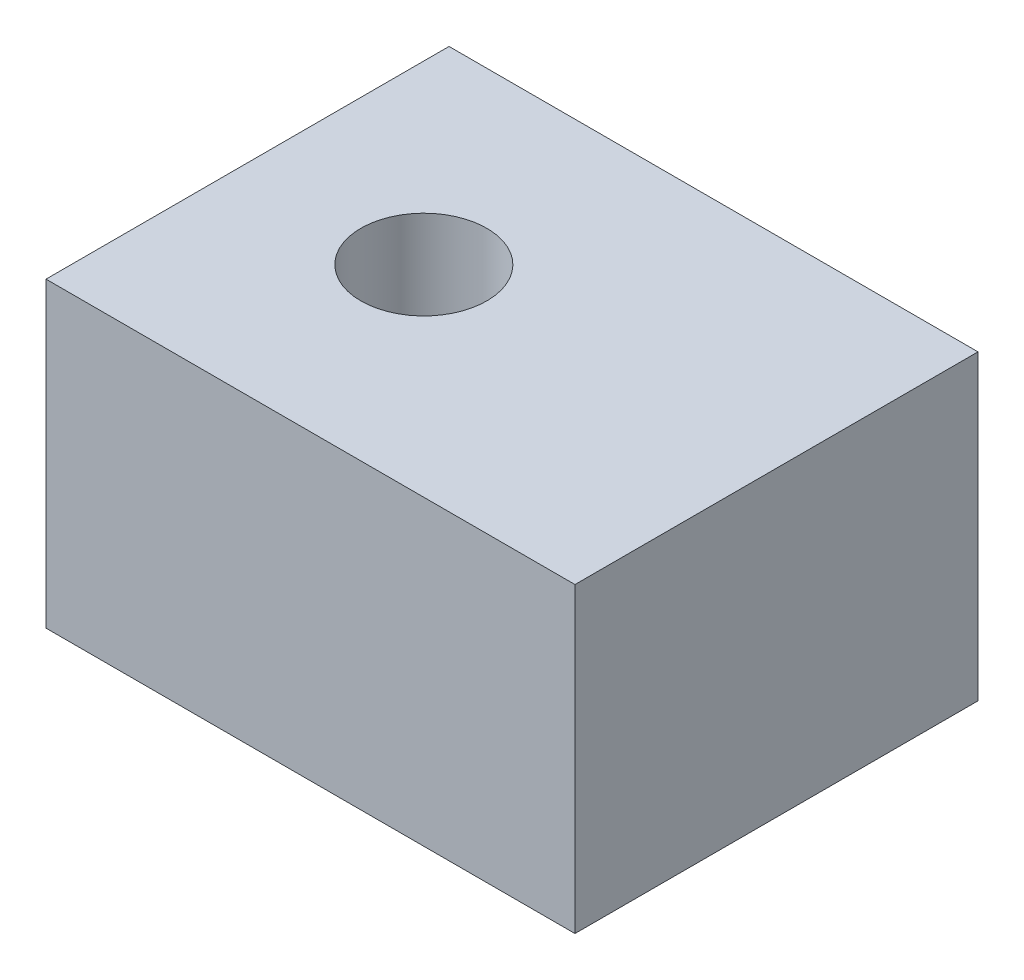
ISO-10303-21;
HEADER;
FILE_DESCRIPTION(('STEP AP214'),'2;1');
FILE_NAME('part.step','',(''),(''),'','','');
FILE_SCHEMA(('AUTOMOTIVE_DESIGN { 1 0 10303 214 1 1 1 1 }'));
ENDSEC;
DATA;
#1=APPLICATION_CONTEXT('core data for automotive mechanical design processes');
#2=APPLICATION_PROTOCOL_DEFINITION('international standard','automotive_design',2000,#1);
#3=PRODUCT_CONTEXT('',#1,'mechanical');
#4=PRODUCT('Part','Part','',(#3));
#5=PRODUCT_RELATED_PRODUCT_CATEGORY('part','',(#4));
#6=PRODUCT_DEFINITION_FORMATION('','',#4);
#7=PRODUCT_DEFINITION_CONTEXT('part definition',#1,'design');
#8=PRODUCT_DEFINITION('design','',#6,#7);
#9=PRODUCT_DEFINITION_SHAPE('','',#8);
#10=(LENGTH_UNIT() NAMED_UNIT(*) SI_UNIT(.MILLI.,.METRE.));
#11=(NAMED_UNIT(*) PLANE_ANGLE_UNIT() SI_UNIT($,.RADIAN.));
#12=(NAMED_UNIT(*) SI_UNIT($,.STERADIAN.) SOLID_ANGLE_UNIT());
#13=UNCERTAINTY_MEASURE_WITH_UNIT(LENGTH_MEASURE(1.E-05),#10,'distance_accuracy_value','');
#14=(GEOMETRIC_REPRESENTATION_CONTEXT(3) GLOBAL_UNCERTAINTY_ASSIGNED_CONTEXT((#13)) GLOBAL_UNIT_ASSIGNED_CONTEXT((#10,
#11,#12)) REPRESENTATION_CONTEXT('',''));
#15=CARTESIAN_POINT('',(0.,0.,0.));
#16=DIRECTION('',(0.,0.,1.));
#17=DIRECTION('',(1.,0.,0.));
#18=AXIS2_PLACEMENT_3D('',#15,#16,#17);
#19=CARTESIAN_POINT('',(6.25,-5.,0.));
#20=DIRECTION('',(0.,-1.,0.));
#21=DIRECTION('',(1.,0.,0.));
#22=AXIS2_PLACEMENT_3D('',#19,#20,#21);
#23=PLANE('',#22);
#24=CARTESIAN_POINT('',(7.,-4.99999999999545,0.));
#25=DIRECTION('',(0.,1.,0.));
#26=DIRECTION('',(-1.,0.,0.));
#27=AXIS2_PLACEMENT_3D('',#24,#25,#26);
#28=CIRCLE('',#27,0.749999999920421);
#29=CARTESIAN_POINT('',(6.25000000007958,-4.99999999999545,0.));
#30=VERTEX_POINT('',#29);
#31=EDGE_CURVE('E92',#30,#30,#28,.T.);
#32=ORIENTED_EDGE('',*,*,#31,.F.);
#33=EDGE_LOOP('',(#32));
#34=FACE_BOUND('',#33,.T.);
#35=CARTESIAN_POINT('',(7.,-4.99999999993861,0.));
#36=DIRECTION('',(0.,-1.,0.));
#37=DIRECTION('',(1.,0.,0.));
#38=AXIS2_PLACEMENT_3D('',#35,#36,#37);
#39=CIRCLE('',#38,0.399999999904591);
#40=CARTESIAN_POINT('',(7.39999999990459,-4.99999999993861,0.));
#41=VERTEX_POINT('',#40);
#42=EDGE_CURVE('E20',#41,#41,#39,.F.);
#43=ORIENTED_EDGE('',*,*,#42,.T.);
#44=EDGE_LOOP('',(#43));
#45=FACE_BOUND('',#44,.T.);
#46=ADVANCED_FACE('F17',(#34,#45),#23,.T.);
#47=CARTESIAN_POINT('',(7.,-4.99999999982492,0.));
#48=DIRECTION('',(0.,-1.,0.));
#49=DIRECTION('',(1.,0.,0.));
#50=AXIS2_PLACEMENT_3D('',#47,#48,#49);
#51=CONICAL_SURFACE('',#50,0.399999999790904,0.785398163255335);
#52=ORIENTED_EDGE('',*,*,#42,.F.);
#53=EDGE_LOOP('',(#52));
#54=FACE_BOUND('',#53,.T.);
#55=CARTESIAN_POINT('',(7.,-4.80000000000001,0.));
#56=DIRECTION('',(0.,-1.,0.));
#57=DIRECTION('',(1.,0.,0.));
#58=AXIS2_PLACEMENT_3D('',#55,#56,#57);
#59=CIRCLE('',#58,0.2);
#60=CARTESIAN_POINT('',(7.2,-4.80000000000001,0.));
#61=VERTEX_POINT('',#60);
#62=EDGE_CURVE('E89',#61,#61,#59,.F.);
#63=ORIENTED_EDGE('',*,*,#62,.T.);
#64=EDGE_LOOP('',(#63));
#65=FACE_BOUND('',#64,.T.);
#66=ADVANCED_FACE('F111',(#54,#65),#51,.F.);
#67=CARTESIAN_POINT('',(7.,-0.999999999862666,0.));
#68=DIRECTION('',(0.,1.,0.));
#69=DIRECTION('',(-1.,0.,0.));
#70=AXIS2_PLACEMENT_3D('',#67,#68,#69);
#71=CONICAL_SURFACE('',#70,3.70000000003256,0.635452992826304);
#72=CARTESIAN_POINT('',(7.,-1.,0.));
#73=DIRECTION('',(0.,1.,0.));
#74=DIRECTION('',(-1.,0.,0.));
#75=AXIS2_PLACEMENT_3D('',#72,#73,#74);
#76=CIRCLE('',#75,3.7);
#77=CARTESIAN_POINT('',(3.3,-1.,0.));
#78=VERTEX_POINT('',#77);
#79=EDGE_CURVE('E85',#78,#78,#76,.T.);
#80=ORIENTED_EDGE('',*,*,#79,.F.);
#81=EDGE_LOOP('',(#80));
#82=FACE_BOUND('',#81,.T.);
#83=ORIENTED_EDGE('',*,*,#31,.T.);
#84=EDGE_LOOP('',(#83));
#85=FACE_BOUND('',#84,.T.);
#86=ADVANCED_FACE('F114',(#82,#85),#71,.T.);
#87=CARTESIAN_POINT('',(7.,12.,0.));
#88=DIRECTION('',(0.,-1.,0.));
#89=DIRECTION('',(1.,0.,0.));
#90=AXIS2_PLACEMENT_3D('',#87,#88,#89);
#91=CYLINDRICAL_SURFACE('',#90,0.2);
#92=ORIENTED_EDGE('',*,*,#62,.F.);
#93=EDGE_LOOP('',(#92));
#94=FACE_BOUND('',#93,.T.);
#95=CARTESIAN_POINT('',(7.,4.,0.));
#96=DIRECTION('',(0.,-1.,0.));
#97=DIRECTION('',(1.,0.,0.));
#98=AXIS2_PLACEMENT_3D('',#95,#96,#97);
#99=CIRCLE('',#98,0.2);
#100=CARTESIAN_POINT('',(7.2,4.,0.));
#101=VERTEX_POINT('',#100);
#102=EDGE_CURVE('E88',#101,#101,#99,.T.);
#103=ORIENTED_EDGE('',*,*,#102,.F.);
#104=EDGE_LOOP('',(#103));
#105=FACE_BOUND('',#104,.T.);
#106=ADVANCED_FACE('F117',(#94,#105),#91,.F.);
#107=CARTESIAN_POINT('',(7.,12.,0.));
#108=DIRECTION('',(0.,1.,0.));
#109=DIRECTION('',(-1.,0.,0.));
#110=AXIS2_PLACEMENT_3D('',#107,#108,#109);
#111=CYLINDRICAL_SURFACE('',#110,3.7);
#112=CARTESIAN_POINT('',(7.,0.,0.));
#113=DIRECTION('',(0.,1.,0.));
#114=DIRECTION('',(-1.,0.,0.));
#115=AXIS2_PLACEMENT_3D('',#112,#113,#114);
#116=CIRCLE('',#115,3.7);
#117=CARTESIAN_POINT('',(3.3,0.,0.));
#118=VERTEX_POINT('',#117);
#119=EDGE_CURVE('E100',#118,#118,#116,.T.);
#120=ORIENTED_EDGE('',*,*,#119,.F.);
#121=EDGE_LOOP('',(#120));
#122=FACE_BOUND('',#121,.T.);
#123=ORIENTED_EDGE('',*,*,#79,.T.);
#124=EDGE_LOOP('',(#123));
#125=FACE_BOUND('',#124,.T.);
#126=ADVANCED_FACE('F120',(#122,#125),#111,.T.);
#127=CARTESIAN_POINT('',(7.,4.,0.));
#128=DIRECTION('',(0.,1.,0.));
#129=DIRECTION('',(0.,0.,1.));
#130=AXIS2_PLACEMENT_3D('',#127,#128,#129);
#131=PLANE('',#130);
#132=ORIENTED_EDGE('',*,*,#102,.T.);
#133=EDGE_LOOP('',(#132));
#134=FACE_BOUND('',#133,.T.);
#135=CARTESIAN_POINT('',(7.,4.,0.));
#136=DIRECTION('',(0.,1.,0.));
#137=DIRECTION('',(0.,0.,1.));
#138=AXIS2_PLACEMENT_3D('',#135,#136,#137);
#139=CIRCLE('',#138,2.5);
#140=CARTESIAN_POINT('',(7.,4.,2.5));
#141=VERTEX_POINT('',#140);
#142=EDGE_CURVE('E74',#141,#141,#139,.T.);
#143=ORIENTED_EDGE('',*,*,#142,.T.);
#144=EDGE_LOOP('',(#143));
#145=FACE_BOUND('',#144,.T.);
#146=ADVANCED_FACE('F124',(#134,#145),#131,.T.);
#147=CARTESIAN_POINT('',(0.,0.,-8.));
#148=DIRECTION('',(0.,-1.,0.));
#149=DIRECTION('',(0.,0.,-1.));
#150=AXIS2_PLACEMENT_3D('',#147,#148,#149);
#151=PLANE('',#150);
#152=DIRECTION('',(0.,0.,1.));
#153=VECTOR('',#152,1.);
#154=CARTESIAN_POINT('',(0.,0.,-8.));
#155=LINE('',#154,#153);
#156=CARTESIAN_POINT('',(0.,0.,-8.));
#157=VERTEX_POINT('',#156);
#158=CARTESIAN_POINT('',(0.,0.,8.));
#159=VERTEX_POINT('',#158);
#160=EDGE_CURVE('E62',#157,#159,#155,.T.);
#161=ORIENTED_EDGE('',*,*,#160,.F.);
#162=DIRECTION('',(-1.,0.,0.));
#163=VECTOR('',#162,1.);
#164=CARTESIAN_POINT('',(0.,0.,-8.));
#165=LINE('',#164,#163);
#166=CARTESIAN_POINT('',(21.,0.,-8.));
#167=VERTEX_POINT('',#166);
#168=EDGE_CURVE('E97',#167,#157,#165,.T.);
#169=ORIENTED_EDGE('',*,*,#168,.F.);
#170=DIRECTION('',(0.,0.,-1.));
#171=VECTOR('',#170,1.);
#172=CARTESIAN_POINT('',(21.,0.,-8.));
#173=LINE('',#172,#171);
#174=CARTESIAN_POINT('',(21.,0.,8.));
#175=VERTEX_POINT('',#174);
#176=EDGE_CURVE('E64',#175,#167,#173,.T.);
#177=ORIENTED_EDGE('',*,*,#176,.F.);
#178=DIRECTION('',(-1.,0.,0.));
#179=VECTOR('',#178,1.);
#180=CARTESIAN_POINT('',(0.,0.,8.));
#181=LINE('',#180,#179);
#182=EDGE_CURVE('E55',#175,#159,#181,.T.);
#183=ORIENTED_EDGE('',*,*,#182,.T.);
#184=EDGE_LOOP('',(#161,#169,#177,#183));
#185=FACE_BOUND('',#184,.T.);
#186=ORIENTED_EDGE('',*,*,#119,.T.);
#187=EDGE_LOOP('',(#186));
#188=FACE_BOUND('',#187,.T.);
#189=ADVANCED_FACE('F59',(#185,#188),#151,.T.);
#190=CARTESIAN_POINT('',(7.,4.,0.));
#191=DIRECTION('',(0.,1.,0.));
#192=DIRECTION('',(0.,0.,1.));
#193=AXIS2_PLACEMENT_3D('',#190,#191,#192);
#194=CYLINDRICAL_SURFACE('',#193,2.5);
#195=CARTESIAN_POINT('',(7.,12.,0.));
#196=DIRECTION('',(0.,1.,0.));
#197=DIRECTION('',(0.,0.,1.));
#198=AXIS2_PLACEMENT_3D('',#195,#196,#197);
#199=CIRCLE('',#198,2.5);
#200=CARTESIAN_POINT('',(7.,12.,2.5));
#201=VERTEX_POINT('',#200);
#202=EDGE_CURVE('E93',#201,#201,#199,.F.);
#203=ORIENTED_EDGE('',*,*,#202,.F.);
#204=EDGE_LOOP('',(#203));
#205=FACE_BOUND('',#204,.T.);
#206=ORIENTED_EDGE('',*,*,#142,.F.);
#207=EDGE_LOOP('',(#206));
#208=FACE_BOUND('',#207,.T.);
#209=ADVANCED_FACE('F130',(#205,#208),#194,.F.);
#210=CARTESIAN_POINT('',(0.,0.,-8.));
#211=DIRECTION('',(-1.,0.,0.));
#212=DIRECTION('',(0.,0.,1.));
#213=AXIS2_PLACEMENT_3D('',#210,#211,#212);
#214=PLANE('',#213);
#215=DIRECTION('',(0.,0.,1.));
#216=VECTOR('',#215,1.);
#217=CARTESIAN_POINT('',(0.,12.,-8.));
#218=LINE('',#217,#216);
#219=CARTESIAN_POINT('',(0.,12.,-8.));
#220=VERTEX_POINT('',#219);
#221=CARTESIAN_POINT('',(0.,12.,8.));
#222=VERTEX_POINT('',#221);
#223=EDGE_CURVE('E96',#220,#222,#218,.T.);
#224=ORIENTED_EDGE('',*,*,#223,.F.);
#225=DIRECTION('',(0.,1.,0.));
#226=VECTOR('',#225,1.);
#227=CARTESIAN_POINT('',(0.,12.,-8.));
#228=LINE('',#227,#226);
#229=EDGE_CURVE('E72',#157,#220,#228,.T.);
#230=ORIENTED_EDGE('',*,*,#229,.F.);
#231=ORIENTED_EDGE('',*,*,#160,.T.);
#232=DIRECTION('',(0.,1.,0.));
#233=VECTOR('',#232,1.);
#234=CARTESIAN_POINT('',(0.,12.,8.));
#235=LINE('',#234,#233);
#236=EDGE_CURVE('E66',#159,#222,#235,.T.);
#237=ORIENTED_EDGE('',*,*,#236,.T.);
#238=EDGE_LOOP('',(#224,#230,#231,#237));
#239=FACE_BOUND('',#238,.T.);
#240=ADVANCED_FACE('F69',(#239),#214,.T.);
#241=CARTESIAN_POINT('',(0.,12.,8.));
#242=DIRECTION('',(0.,0.,-1.));
#243=DIRECTION('',(-1.,0.,0.));
#244=AXIS2_PLACEMENT_3D('',#241,#242,#243);
#245=PLANE('',#244);
#246=ORIENTED_EDGE('',*,*,#182,.F.);
#247=DIRECTION('',(0.,1.,0.));
#248=VECTOR('',#247,1.);
#249=CARTESIAN_POINT('',(21.,0.,8.));
#250=LINE('',#249,#248);
#251=CARTESIAN_POINT('',(21.,12.,8.));
#252=VERTEX_POINT('',#251);
#253=EDGE_CURVE('E80',#252,#175,#250,.F.);
#254=ORIENTED_EDGE('',*,*,#253,.F.);
#255=DIRECTION('',(1.,0.,0.));
#256=VECTOR('',#255,1.);
#257=CARTESIAN_POINT('',(0.,12.,8.));
#258=LINE('',#257,#256);
#259=EDGE_CURVE('E78',#222,#252,#258,.T.);
#260=ORIENTED_EDGE('',*,*,#259,.F.);
#261=ORIENTED_EDGE('',*,*,#236,.F.);
#262=EDGE_LOOP('',(#246,#254,#260,#261));
#263=FACE_BOUND('',#262,.T.);
#264=ADVANCED_FACE('F76',(#263),#245,.F.);
#265=CARTESIAN_POINT('',(21.,0.,-8.));
#266=DIRECTION('',(1.,0.,0.));
#267=DIRECTION('',(0.,0.,-1.));
#268=AXIS2_PLACEMENT_3D('',#265,#266,#267);
#269=PLANE('',#268);
#270=ORIENTED_EDGE('',*,*,#176,.T.);
#271=DIRECTION('',(0.,1.,0.));
#272=VECTOR('',#271,1.);
#273=CARTESIAN_POINT('',(21.,12.,-8.));
#274=LINE('',#273,#272);
#275=CARTESIAN_POINT('',(21.,12.,-8.));
#276=VERTEX_POINT('',#275);
#277=EDGE_CURVE('E35',#276,#167,#274,.F.);
#278=ORIENTED_EDGE('',*,*,#277,.F.);
#279=DIRECTION('',(0.,0.,1.));
#280=VECTOR('',#279,1.);
#281=CARTESIAN_POINT('',(21.,12.,-8.));
#282=LINE('',#281,#280);
#283=EDGE_CURVE('E26',#252,#276,#282,.F.);
#284=ORIENTED_EDGE('',*,*,#283,.F.);
#285=ORIENTED_EDGE('',*,*,#253,.T.);
#286=EDGE_LOOP('',(#270,#278,#284,#285));
#287=FACE_BOUND('',#286,.T.);
#288=ADVANCED_FACE('F150',(#287),#269,.T.);
#289=CARTESIAN_POINT('',(0.,12.,-8.));
#290=DIRECTION('',(0.,0.,-1.));
#291=DIRECTION('',(-1.,0.,0.));
#292=AXIS2_PLACEMENT_3D('',#289,#290,#291);
#293=PLANE('',#292);
#294=ORIENTED_EDGE('',*,*,#277,.T.);
#295=ORIENTED_EDGE('',*,*,#168,.T.);
#296=ORIENTED_EDGE('',*,*,#229,.T.);
#297=DIRECTION('',(1.,0.,0.));
#298=VECTOR('',#297,1.);
#299=CARTESIAN_POINT('',(0.,12.,-8.));
#300=LINE('',#299,#298);
#301=EDGE_CURVE('E11',#276,#220,#300,.F.);
#302=ORIENTED_EDGE('',*,*,#301,.F.);
#303=EDGE_LOOP('',(#294,#295,#296,#302));
#304=FACE_BOUND('',#303,.T.);
#305=ADVANCED_FACE('F144',(#304),#293,.T.);
#306=CARTESIAN_POINT('',(0.,12.,-8.));
#307=DIRECTION('',(0.,1.,0.));
#308=DIRECTION('',(0.,0.,1.));
#309=AXIS2_PLACEMENT_3D('',#306,#307,#308);
#310=PLANE('',#309);
#311=ORIENTED_EDGE('',*,*,#283,.T.);
#312=ORIENTED_EDGE('',*,*,#301,.T.);
#313=ORIENTED_EDGE('',*,*,#223,.T.);
#314=ORIENTED_EDGE('',*,*,#259,.T.);
#315=EDGE_LOOP('',(#311,#312,#313,#314));
#316=FACE_BOUND('',#315,.T.);
#317=ORIENTED_EDGE('',*,*,#202,.T.);
#318=EDGE_LOOP('',(#317));
#319=FACE_BOUND('',#318,.T.);
#320=ADVANCED_FACE('F142',(#316,#319),#310,.T.);
#321=CLOSED_SHELL('',(#46,#66,#86,#106,#126,#146,#189,#209,#240,#264,#288,#305,#320));
#322=MANIFOLD_SOLID_BREP('B1',#321);
#323=ADVANCED_BREP_SHAPE_REPRESENTATION('',(#18,#322),#14);
#324=SHAPE_DEFINITION_REPRESENTATION(#9,#323);
ENDSEC;
END-ISO-10303-21;
